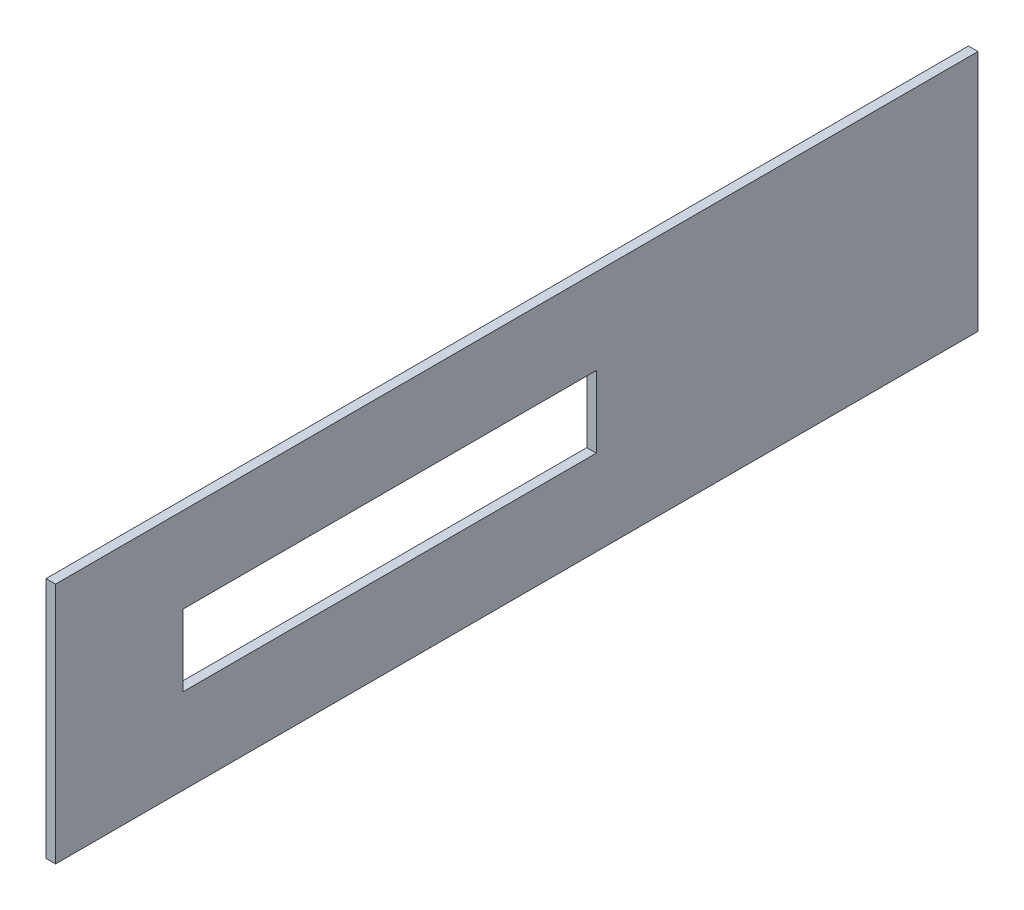
ISO-10303-21;
HEADER;
FILE_DESCRIPTION(('STEP AP214'),'2;1');
FILE_NAME('part.step','',(''),(''),'','','');
FILE_SCHEMA(('AUTOMOTIVE_DESIGN { 1 0 10303 214 1 1 1 1 }'));
ENDSEC;
DATA;
#1=APPLICATION_CONTEXT('core data for automotive mechanical design processes');
#2=APPLICATION_PROTOCOL_DEFINITION('international standard','automotive_design',2000,#1);
#3=PRODUCT_CONTEXT('',#1,'mechanical');
#4=PRODUCT('Part','Part','',(#3));
#5=PRODUCT_RELATED_PRODUCT_CATEGORY('part','',(#4));
#6=PRODUCT_DEFINITION_FORMATION('','',#4);
#7=PRODUCT_DEFINITION_CONTEXT('part definition',#1,'design');
#8=PRODUCT_DEFINITION('design','',#6,#7);
#9=PRODUCT_DEFINITION_SHAPE('','',#8);
#10=(LENGTH_UNIT() NAMED_UNIT(*) SI_UNIT(.MILLI.,.METRE.));
#11=(NAMED_UNIT(*) PLANE_ANGLE_UNIT() SI_UNIT($,.RADIAN.));
#12=(NAMED_UNIT(*) SI_UNIT($,.STERADIAN.) SOLID_ANGLE_UNIT());
#13=UNCERTAINTY_MEASURE_WITH_UNIT(LENGTH_MEASURE(1.E-05),#10,'distance_accuracy_value','');
#14=(GEOMETRIC_REPRESENTATION_CONTEXT(3) GLOBAL_UNCERTAINTY_ASSIGNED_CONTEXT((#13)) GLOBAL_UNIT_ASSIGNED_CONTEXT((#10,
#11,#12)) REPRESENTATION_CONTEXT('',''));
#15=CARTESIAN_POINT('',(0.,0.,0.));
#16=DIRECTION('',(0.,0.,1.));
#17=DIRECTION('',(1.,0.,0.));
#18=AXIS2_PLACEMENT_3D('',#15,#16,#17);
#19=CARTESIAN_POINT('',(3.,-38.1,-145.));
#20=DIRECTION('',(0.,0.,1.));
#21=DIRECTION('',(1.,0.,0.));
#22=AXIS2_PLACEMENT_3D('',#19,#20,#21);
#23=PLANE('',#22);
#24=DIRECTION('',(0.,1.,0.));
#25=VECTOR('',#24,1.);
#26=CARTESIAN_POINT('',(0.,-38.1,-145.));
#27=LINE('',#26,#25);
#28=CARTESIAN_POINT('',(0.,-38.1,-145.));
#29=VERTEX_POINT('',#28);
#30=CARTESIAN_POINT('',(0.,38.1,-145.));
#31=VERTEX_POINT('',#30);
#32=EDGE_CURVE('E147',#29,#31,#27,.T.);
#33=ORIENTED_EDGE('',*,*,#32,.T.);
#34=DIRECTION('',(-1.,0.,0.));
#35=VECTOR('',#34,1.);
#36=CARTESIAN_POINT('',(3.,38.1,-145.));
#37=LINE('',#36,#35);
#38=CARTESIAN_POINT('',(3.,38.1,-145.));
#39=VERTEX_POINT('',#38);
#40=EDGE_CURVE('E11',#39,#31,#37,.T.);
#41=ORIENTED_EDGE('',*,*,#40,.F.);
#42=DIRECTION('',(0.,1.,0.));
#43=VECTOR('',#42,1.);
#44=CARTESIAN_POINT('',(3.,-38.1,-145.));
#45=LINE('',#44,#43);
#46=CARTESIAN_POINT('',(3.,-38.1,-145.));
#47=VERTEX_POINT('',#46);
#48=EDGE_CURVE('E153',#47,#39,#45,.T.);
#49=ORIENTED_EDGE('',*,*,#48,.F.);
#50=DIRECTION('',(-1.,0.,0.));
#51=VECTOR('',#50,1.);
#52=CARTESIAN_POINT('',(3.,-38.1,-145.));
#53=LINE('',#52,#51);
#54=EDGE_CURVE('E167',#47,#29,#53,.T.);
#55=ORIENTED_EDGE('',*,*,#54,.T.);
#56=EDGE_LOOP('',(#33,#41,#49,#55));
#57=FACE_BOUND('',#56,.T.);
#58=ADVANCED_FACE('F39',(#57),#23,.F.);
#59=CARTESIAN_POINT('',(3.,38.1,145.));
#60=DIRECTION('',(0.,-1.,0.));
#61=DIRECTION('',(0.,0.,-1.));
#62=AXIS2_PLACEMENT_3D('',#59,#60,#61);
#63=PLANE('',#62);
#64=DIRECTION('',(0.,0.,1.));
#65=VECTOR('',#64,1.);
#66=CARTESIAN_POINT('',(0.,38.1,145.));
#67=LINE('',#66,#65);
#68=CARTESIAN_POINT('',(0.,38.1,145.));
#69=VERTEX_POINT('',#68);
#70=EDGE_CURVE('E171',#31,#69,#67,.T.);
#71=ORIENTED_EDGE('',*,*,#70,.T.);
#72=DIRECTION('',(-1.,0.,0.));
#73=VECTOR('',#72,1.);
#74=CARTESIAN_POINT('',(3.,38.1,145.));
#75=LINE('',#74,#73);
#76=CARTESIAN_POINT('',(3.,38.1,145.));
#77=VERTEX_POINT('',#76);
#78=EDGE_CURVE('E47',#77,#69,#75,.T.);
#79=ORIENTED_EDGE('',*,*,#78,.F.);
#80=DIRECTION('',(0.,0.,1.));
#81=VECTOR('',#80,1.);
#82=CARTESIAN_POINT('',(3.,38.1,145.));
#83=LINE('',#82,#81);
#84=EDGE_CURVE('E157',#39,#77,#83,.T.);
#85=ORIENTED_EDGE('',*,*,#84,.F.);
#86=ORIENTED_EDGE('',*,*,#40,.T.);
#87=EDGE_LOOP('',(#71,#79,#85,#86));
#88=FACE_BOUND('',#87,.T.);
#89=ADVANCED_FACE('F205',(#88),#63,.F.);
#90=CARTESIAN_POINT('',(3.,-38.1,145.));
#91=DIRECTION('',(0.,0.,-1.));
#92=DIRECTION('',(-1.,0.,0.));
#93=AXIS2_PLACEMENT_3D('',#90,#91,#92);
#94=PLANE('',#93);
#95=DIRECTION('',(0.,-1.,0.));
#96=VECTOR('',#95,1.);
#97=CARTESIAN_POINT('',(0.,-38.1,145.));
#98=LINE('',#97,#96);
#99=CARTESIAN_POINT('',(0.,-38.1,145.));
#100=VERTEX_POINT('',#99);
#101=EDGE_CURVE('E174',#69,#100,#98,.T.);
#102=ORIENTED_EDGE('',*,*,#101,.T.);
#103=DIRECTION('',(-1.,0.,0.));
#104=VECTOR('',#103,1.);
#105=CARTESIAN_POINT('',(3.,-38.1,145.));
#106=LINE('',#105,#104);
#107=CARTESIAN_POINT('',(3.,-38.1,145.));
#108=VERTEX_POINT('',#107);
#109=EDGE_CURVE('E182',#108,#100,#106,.T.);
#110=ORIENTED_EDGE('',*,*,#109,.F.);
#111=DIRECTION('',(0.,-1.,0.));
#112=VECTOR('',#111,1.);
#113=CARTESIAN_POINT('',(3.,-38.1,145.));
#114=LINE('',#113,#112);
#115=EDGE_CURVE('E161',#77,#108,#114,.T.);
#116=ORIENTED_EDGE('',*,*,#115,.F.);
#117=ORIENTED_EDGE('',*,*,#78,.T.);
#118=EDGE_LOOP('',(#102,#110,#116,#117));
#119=FACE_BOUND('',#118,.T.);
#120=ADVANCED_FACE('F191',(#119),#94,.F.);
#121=CARTESIAN_POINT('',(3.,-38.1,145.));
#122=DIRECTION('',(0.,1.,0.));
#123=DIRECTION('',(0.,0.,1.));
#124=AXIS2_PLACEMENT_3D('',#121,#122,#123);
#125=PLANE('',#124);
#126=DIRECTION('',(0.,0.,-1.));
#127=VECTOR('',#126,1.);
#128=CARTESIAN_POINT('',(0.,-38.1,145.));
#129=LINE('',#128,#127);
#130=EDGE_CURVE('E158',#100,#29,#129,.T.);
#131=ORIENTED_EDGE('',*,*,#130,.T.);
#132=ORIENTED_EDGE('',*,*,#54,.F.);
#133=DIRECTION('',(0.,0.,-1.));
#134=VECTOR('',#133,1.);
#135=CARTESIAN_POINT('',(3.,-38.1,145.));
#136=LINE('',#135,#134);
#137=EDGE_CURVE('E164',#108,#47,#136,.T.);
#138=ORIENTED_EDGE('',*,*,#137,.F.);
#139=ORIENTED_EDGE('',*,*,#109,.T.);
#140=EDGE_LOOP('',(#131,#132,#138,#139));
#141=FACE_BOUND('',#140,.T.);
#142=ADVANCED_FACE('F198',(#141),#125,.F.);
#143=CARTESIAN_POINT('',(3.,0.,0.));
#144=DIRECTION('',(-1.,0.,0.));
#145=DIRECTION('',(0.,0.,1.));
#146=AXIS2_PLACEMENT_3D('',#143,#144,#145);
#147=PLANE('',#146);
#148=DIRECTION('',(0.,1.,0.));
#149=VECTOR('',#148,1.);
#150=CARTESIAN_POINT('',(3.,-11.25,-25.));
#151=LINE('',#150,#149);
#152=CARTESIAN_POINT('',(3.,-11.25,-25.));
#153=VERTEX_POINT('',#152);
#154=CARTESIAN_POINT('',(3.,11.25,-25.));
#155=VERTEX_POINT('',#154);
#156=EDGE_CURVE('E138',#153,#155,#151,.T.);
#157=ORIENTED_EDGE('',*,*,#156,.F.);
#158=DIRECTION('',(0.,0.,-1.));
#159=VECTOR('',#158,1.);
#160=CARTESIAN_POINT('',(3.,-11.25,105.));
#161=LINE('',#160,#159);
#162=CARTESIAN_POINT('',(3.,-11.25,105.));
#163=VERTEX_POINT('',#162);
#164=EDGE_CURVE('E54',#163,#153,#161,.T.);
#165=ORIENTED_EDGE('',*,*,#164,.F.);
#166=DIRECTION('',(0.,-1.,0.));
#167=VECTOR('',#166,1.);
#168=CARTESIAN_POINT('',(3.,11.25,105.));
#169=LINE('',#168,#167);
#170=CARTESIAN_POINT('',(3.,11.25,105.));
#171=VERTEX_POINT('',#170);
#172=EDGE_CURVE('E125',#171,#163,#169,.T.);
#173=ORIENTED_EDGE('',*,*,#172,.F.);
#174=DIRECTION('',(0.,0.,1.));
#175=VECTOR('',#174,1.);
#176=CARTESIAN_POINT('',(3.,11.25,-25.));
#177=LINE('',#176,#175);
#178=EDGE_CURVE('E129',#155,#171,#177,.T.);
#179=ORIENTED_EDGE('',*,*,#178,.F.);
#180=EDGE_LOOP('',(#157,#165,#173,#179));
#181=FACE_BOUND('',#180,.T.);
#182=ORIENTED_EDGE('',*,*,#48,.T.);
#183=ORIENTED_EDGE('',*,*,#84,.T.);
#184=ORIENTED_EDGE('',*,*,#115,.T.);
#185=ORIENTED_EDGE('',*,*,#137,.T.);
#186=EDGE_LOOP('',(#182,#183,#184,#185));
#187=FACE_BOUND('',#186,.T.);
#188=ADVANCED_FACE('F204',(#181,#187),#147,.F.);
#189=CARTESIAN_POINT('',(0.,0.,0.));
#190=DIRECTION('',(-1.,0.,0.));
#191=DIRECTION('',(0.,0.,1.));
#192=AXIS2_PLACEMENT_3D('',#189,#190,#191);
#193=PLANE('',#192);
#194=DIRECTION('',(0.,0.,-1.));
#195=VECTOR('',#194,1.);
#196=CARTESIAN_POINT('',(0.,-11.25,105.));
#197=LINE('',#196,#195);
#198=CARTESIAN_POINT('',(0.,-11.25,105.));
#199=VERTEX_POINT('',#198);
#200=CARTESIAN_POINT('',(0.,-11.25,-25.));
#201=VERTEX_POINT('',#200);
#202=EDGE_CURVE('E106',#199,#201,#197,.T.);
#203=ORIENTED_EDGE('',*,*,#202,.T.);
#204=DIRECTION('',(0.,1.,0.));
#205=VECTOR('',#204,1.);
#206=CARTESIAN_POINT('',(0.,-11.25,-25.));
#207=LINE('',#206,#205);
#208=CARTESIAN_POINT('',(0.,11.25,-25.));
#209=VERTEX_POINT('',#208);
#210=EDGE_CURVE('E116',#201,#209,#207,.T.);
#211=ORIENTED_EDGE('',*,*,#210,.T.);
#212=DIRECTION('',(0.,0.,1.));
#213=VECTOR('',#212,1.);
#214=CARTESIAN_POINT('',(0.,11.25,-25.));
#215=LINE('',#214,#213);
#216=CARTESIAN_POINT('',(0.,11.25,105.));
#217=VERTEX_POINT('',#216);
#218=EDGE_CURVE('E62',#209,#217,#215,.T.);
#219=ORIENTED_EDGE('',*,*,#218,.T.);
#220=DIRECTION('',(0.,-1.,0.));
#221=VECTOR('',#220,1.);
#222=CARTESIAN_POINT('',(0.,11.25,105.));
#223=LINE('',#222,#221);
#224=EDGE_CURVE('E113',#217,#199,#223,.T.);
#225=ORIENTED_EDGE('',*,*,#224,.T.);
#226=EDGE_LOOP('',(#203,#211,#219,#225));
#227=FACE_BOUND('',#226,.T.);
#228=ORIENTED_EDGE('',*,*,#32,.F.);
#229=ORIENTED_EDGE('',*,*,#130,.F.);
#230=ORIENTED_EDGE('',*,*,#101,.F.);
#231=ORIENTED_EDGE('',*,*,#70,.F.);
#232=EDGE_LOOP('',(#228,#229,#230,#231));
#233=FACE_BOUND('',#232,.T.);
#234=ADVANCED_FACE('F121',(#227,#233),#193,.T.);
#235=CARTESIAN_POINT('',(0.,-11.25,105.));
#236=DIRECTION('',(0.,-1.,0.));
#237=DIRECTION('',(0.,0.,-1.));
#238=AXIS2_PLACEMENT_3D('',#235,#236,#237);
#239=PLANE('',#238);
#240=ORIENTED_EDGE('',*,*,#164,.T.);
#241=DIRECTION('',(1.,0.,0.));
#242=VECTOR('',#241,1.);
#243=CARTESIAN_POINT('',(0.,-11.25,-25.));
#244=LINE('',#243,#242);
#245=EDGE_CURVE('E102',#201,#153,#244,.T.);
#246=ORIENTED_EDGE('',*,*,#245,.F.);
#247=ORIENTED_EDGE('',*,*,#202,.F.);
#248=DIRECTION('',(1.,0.,0.));
#249=VECTOR('',#248,1.);
#250=CARTESIAN_POINT('',(0.,-11.25,105.));
#251=LINE('',#250,#249);
#252=EDGE_CURVE('E144',#199,#163,#251,.T.);
#253=ORIENTED_EDGE('',*,*,#252,.T.);
#254=EDGE_LOOP('',(#240,#246,#247,#253));
#255=FACE_BOUND('',#254,.T.);
#256=ADVANCED_FACE('F104',(#255),#239,.F.);
#257=CARTESIAN_POINT('',(0.,11.25,105.));
#258=DIRECTION('',(0.,0.,1.));
#259=DIRECTION('',(1.,0.,0.));
#260=AXIS2_PLACEMENT_3D('',#257,#258,#259);
#261=PLANE('',#260);
#262=ORIENTED_EDGE('',*,*,#172,.T.);
#263=ORIENTED_EDGE('',*,*,#252,.F.);
#264=ORIENTED_EDGE('',*,*,#224,.F.);
#265=DIRECTION('',(1.,0.,0.));
#266=VECTOR('',#265,1.);
#267=CARTESIAN_POINT('',(0.,11.25,105.));
#268=LINE('',#267,#266);
#269=EDGE_CURVE('E148',#217,#171,#268,.T.);
#270=ORIENTED_EDGE('',*,*,#269,.T.);
#271=EDGE_LOOP('',(#262,#263,#264,#270));
#272=FACE_BOUND('',#271,.T.);
#273=ADVANCED_FACE('F222',(#272),#261,.F.);
#274=CARTESIAN_POINT('',(0.,11.25,-25.));
#275=DIRECTION('',(0.,1.,0.));
#276=DIRECTION('',(0.,0.,1.));
#277=AXIS2_PLACEMENT_3D('',#274,#275,#276);
#278=PLANE('',#277);
#279=ORIENTED_EDGE('',*,*,#178,.T.);
#280=ORIENTED_EDGE('',*,*,#269,.F.);
#281=ORIENTED_EDGE('',*,*,#218,.F.);
#282=DIRECTION('',(1.,0.,0.));
#283=VECTOR('',#282,1.);
#284=CARTESIAN_POINT('',(0.,11.25,-25.));
#285=LINE('',#284,#283);
#286=EDGE_CURVE('E112',#209,#155,#285,.T.);
#287=ORIENTED_EDGE('',*,*,#286,.T.);
#288=EDGE_LOOP('',(#279,#280,#281,#287));
#289=FACE_BOUND('',#288,.T.);
#290=ADVANCED_FACE('F225',(#289),#278,.F.);
#291=CARTESIAN_POINT('',(0.,-11.25,-25.));
#292=DIRECTION('',(0.,0.,-1.));
#293=DIRECTION('',(-1.,0.,0.));
#294=AXIS2_PLACEMENT_3D('',#291,#292,#293);
#295=PLANE('',#294);
#296=ORIENTED_EDGE('',*,*,#156,.T.);
#297=ORIENTED_EDGE('',*,*,#286,.F.);
#298=ORIENTED_EDGE('',*,*,#210,.F.);
#299=ORIENTED_EDGE('',*,*,#245,.T.);
#300=EDGE_LOOP('',(#296,#297,#298,#299));
#301=FACE_BOUND('',#300,.T.);
#302=ADVANCED_FACE('F117',(#301),#295,.F.);
#303=CLOSED_SHELL('',(#58,#89,#120,#142,#188,#234,#256,#273,#290,#302));
#304=MANIFOLD_SOLID_BREP('B2',#303);
#305=ADVANCED_BREP_SHAPE_REPRESENTATION('',(#18,#304),#14);
#306=SHAPE_DEFINITION_REPRESENTATION(#9,#305);
ENDSEC;
END-ISO-10303-21;
